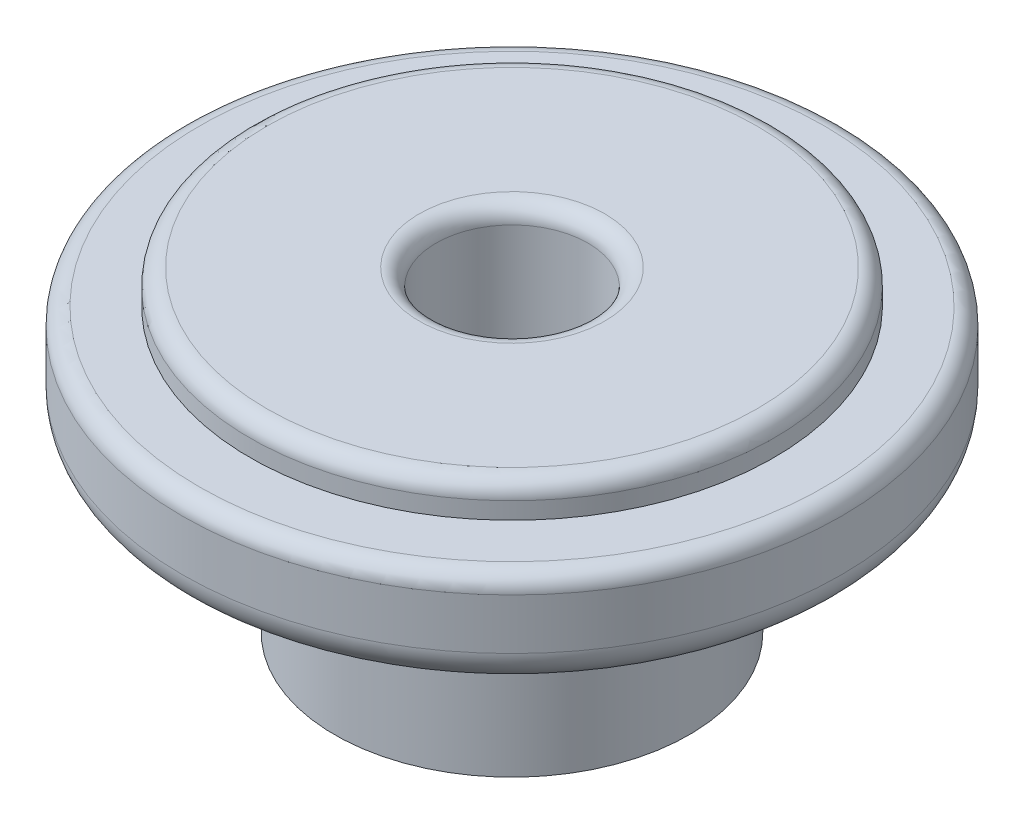
ISO-10303-21;
HEADER;
FILE_DESCRIPTION(('STEP AP214'),'2;1');
FILE_NAME('part.step','',(''),(''),'','','');
FILE_SCHEMA(('AUTOMOTIVE_DESIGN { 1 0 10303 214 1 1 1 1 }'));
ENDSEC;
DATA;
#1=APPLICATION_CONTEXT('core data for automotive mechanical design processes');
#2=APPLICATION_PROTOCOL_DEFINITION('international standard','automotive_design',2000,#1);
#3=PRODUCT_CONTEXT('',#1,'mechanical');
#4=PRODUCT('Part','Part','',(#3));
#5=PRODUCT_RELATED_PRODUCT_CATEGORY('part','',(#4));
#6=PRODUCT_DEFINITION_FORMATION('','',#4);
#7=PRODUCT_DEFINITION_CONTEXT('part definition',#1,'design');
#8=PRODUCT_DEFINITION('design','',#6,#7);
#9=PRODUCT_DEFINITION_SHAPE('','',#8);
#10=(LENGTH_UNIT() NAMED_UNIT(*) SI_UNIT(.MILLI.,.METRE.));
#11=(NAMED_UNIT(*) PLANE_ANGLE_UNIT() SI_UNIT($,.RADIAN.));
#12=(NAMED_UNIT(*) SI_UNIT($,.STERADIAN.) SOLID_ANGLE_UNIT());
#13=UNCERTAINTY_MEASURE_WITH_UNIT(LENGTH_MEASURE(1.E-05),#10,'distance_accuracy_value','');
#14=(GEOMETRIC_REPRESENTATION_CONTEXT(3) GLOBAL_UNCERTAINTY_ASSIGNED_CONTEXT((#13)) GLOBAL_UNIT_ASSIGNED_CONTEXT((#10,
#11,#12)) REPRESENTATION_CONTEXT('',''));
#15=CARTESIAN_POINT('',(0.,0.,0.));
#16=DIRECTION('',(0.,0.,1.));
#17=DIRECTION('',(1.,0.,0.));
#18=AXIS2_PLACEMENT_3D('',#15,#16,#17);
#19=CARTESIAN_POINT('',(-2.2479,0.,0.));
#20=DIRECTION('',(0.,1.,0.));
#21=DIRECTION('',(0.,0.,1.));
#22=AXIS2_PLACEMENT_3D('',#19,#20,#21);
#23=PLANE('',#22);
#24=CARTESIAN_POINT('',(0.,0.,0.));
#25=DIRECTION('',(0.,-1.,0.));
#26=DIRECTION('',(0.,0.,-1.));
#27=AXIS2_PLACEMENT_3D('',#24,#25,#26);
#28=CIRCLE('',#27,2.2479);
#29=CARTESIAN_POINT('',(0.,0.,-2.2479));
#30=VERTEX_POINT('',#29);
#31=EDGE_CURVE('E75',#30,#30,#28,.T.);
#32=ORIENTED_EDGE('',*,*,#31,.F.);
#33=EDGE_LOOP('',(#32));
#34=FACE_BOUND('',#33,.T.);
#35=CARTESIAN_POINT('',(0.,0.,0.));
#36=DIRECTION('',(0.,-1.,0.));
#37=DIRECTION('',(0.,0.,-1.));
#38=AXIS2_PLACEMENT_3D('',#35,#36,#37);
#39=CIRCLE('',#38,5.2479);
#40=CARTESIAN_POINT('',(0.,0.,-5.2479));
#41=VERTEX_POINT('',#40);
#42=EDGE_CURVE('E95',#41,#41,#39,.T.);
#43=ORIENTED_EDGE('',*,*,#42,.T.);
#44=EDGE_LOOP('',(#43));
#45=FACE_BOUND('',#44,.T.);
#46=ADVANCED_FACE('F43',(#34,#45),#23,.F.);
#47=CARTESIAN_POINT('',(0.,0.,0.));
#48=DIRECTION('',(0.,-1.,0.));
#49=DIRECTION('',(0.,0.,-1.));
#50=AXIS2_PLACEMENT_3D('',#47,#48,#49);
#51=CYLINDRICAL_SURFACE('',#50,2.2479);
#52=CARTESIAN_POINT('',(0.,8.85,0.));
#53=DIRECTION('',(0.,-1.,0.));
#54=DIRECTION('',(0.,0.,-1.));
#55=AXIS2_PLACEMENT_3D('',#52,#53,#54);
#56=CIRCLE('',#55,2.2479);
#57=CARTESIAN_POINT('',(0.,8.85,-2.2479));
#58=VERTEX_POINT('',#57);
#59=EDGE_CURVE('E10',#58,#58,#56,.F.);
#60=ORIENTED_EDGE('',*,*,#59,.T.);
#61=EDGE_LOOP('',(#60));
#62=FACE_BOUND('',#61,.T.);
#63=ORIENTED_EDGE('',*,*,#31,.T.);
#64=EDGE_LOOP('',(#63));
#65=FACE_BOUND('',#64,.T.);
#66=ADVANCED_FACE('F133',(#62,#65),#51,.F.);
#67=CARTESIAN_POINT('',(-2.2479,9.35,0.));
#68=DIRECTION('',(0.,-1.,0.));
#69=DIRECTION('',(0.,0.,-1.));
#70=AXIS2_PLACEMENT_3D('',#67,#68,#69);
#71=PLANE('',#70);
#72=CARTESIAN_POINT('',(0.,9.35,0.));
#73=DIRECTION('',(0.,-1.,0.));
#74=DIRECTION('',(0.,0.,-1.));
#75=AXIS2_PLACEMENT_3D('',#72,#73,#74);
#76=CIRCLE('',#75,7.2479);
#77=CARTESIAN_POINT('',(0.,9.35,-7.2479));
#78=VERTEX_POINT('',#77);
#79=EDGE_CURVE('E51',#78,#78,#76,.F.);
#80=ORIENTED_EDGE('',*,*,#79,.T.);
#81=EDGE_LOOP('',(#80));
#82=FACE_BOUND('',#81,.T.);
#83=CARTESIAN_POINT('',(0.,9.35,0.));
#84=DIRECTION('',(0.,-1.,0.));
#85=DIRECTION('',(0.,0.,-1.));
#86=AXIS2_PLACEMENT_3D('',#83,#84,#85);
#87=CIRCLE('',#86,2.7479);
#88=CARTESIAN_POINT('',(0.,9.35,-2.7479));
#89=VERTEX_POINT('',#88);
#90=EDGE_CURVE('E56',#89,#89,#87,.T.);
#91=ORIENTED_EDGE('',*,*,#90,.T.);
#92=EDGE_LOOP('',(#91));
#93=FACE_BOUND('',#92,.T.);
#94=ADVANCED_FACE('F139',(#82,#93),#71,.F.);
#95=CARTESIAN_POINT('',(0.,0.,0.));
#96=DIRECTION('',(0.,-1.,0.));
#97=DIRECTION('',(0.,0.,-1.));
#98=AXIS2_PLACEMENT_3D('',#95,#96,#97);
#99=CYLINDRICAL_SURFACE('',#98,7.7479);
#100=CARTESIAN_POINT('',(0.,8.85,0.));
#101=DIRECTION('',(0.,-1.,0.));
#102=DIRECTION('',(0.,0.,-1.));
#103=AXIS2_PLACEMENT_3D('',#100,#101,#102);
#104=CIRCLE('',#103,7.7479);
#105=CARTESIAN_POINT('',(0.,8.85,-7.7479));
#106=VERTEX_POINT('',#105);
#107=EDGE_CURVE('E61',#106,#106,#104,.T.);
#108=ORIENTED_EDGE('',*,*,#107,.T.);
#109=EDGE_LOOP('',(#108));
#110=FACE_BOUND('',#109,.T.);
#111=CARTESIAN_POINT('',(0.,8.35,0.));
#112=DIRECTION('',(0.,-1.,0.));
#113=DIRECTION('',(0.,0.,-1.));
#114=AXIS2_PLACEMENT_3D('',#111,#112,#113);
#115=CIRCLE('',#114,7.7479);
#116=CARTESIAN_POINT('',(0.,8.35,-7.7479));
#117=VERTEX_POINT('',#116);
#118=EDGE_CURVE('E79',#117,#117,#115,.T.);
#119=ORIENTED_EDGE('',*,*,#118,.F.);
#120=EDGE_LOOP('',(#119));
#121=FACE_BOUND('',#120,.T.);
#122=ADVANCED_FACE('F129',(#110,#121),#99,.T.);
#123=CARTESIAN_POINT('',(-7.7479,8.35,0.));
#124=DIRECTION('',(0.,-1.,0.));
#125=DIRECTION('',(0.,0.,-1.));
#126=AXIS2_PLACEMENT_3D('',#123,#124,#125);
#127=PLANE('',#126);
#128=CARTESIAN_POINT('',(0.,8.35,0.));
#129=DIRECTION('',(0.,-1.,0.));
#130=DIRECTION('',(0.,0.,-1.));
#131=AXIS2_PLACEMENT_3D('',#128,#129,#130);
#132=CIRCLE('',#131,9.2479);
#133=CARTESIAN_POINT('',(0.,8.35,-9.2479));
#134=VERTEX_POINT('',#133);
#135=EDGE_CURVE('E67',#134,#134,#132,.F.);
#136=ORIENTED_EDGE('',*,*,#135,.T.);
#137=EDGE_LOOP('',(#136));
#138=FACE_BOUND('',#137,.T.);
#139=ORIENTED_EDGE('',*,*,#118,.T.);
#140=EDGE_LOOP('',(#139));
#141=FACE_BOUND('',#140,.T.);
#142=ADVANCED_FACE('F122',(#138,#141),#127,.F.);
#143=CARTESIAN_POINT('',(0.,0.,0.));
#144=DIRECTION('',(0.,-1.,0.));
#145=DIRECTION('',(0.,0.,-1.));
#146=AXIS2_PLACEMENT_3D('',#143,#144,#145);
#147=CYLINDRICAL_SURFACE('',#146,9.7479);
#148=CARTESIAN_POINT('',(0.,7.85,0.));
#149=DIRECTION('',(0.,-1.,0.));
#150=DIRECTION('',(0.,0.,-1.));
#151=AXIS2_PLACEMENT_3D('',#148,#149,#150);
#152=CIRCLE('',#151,9.7479);
#153=CARTESIAN_POINT('',(0.,7.85,-9.7479));
#154=VERTEX_POINT('',#153);
#155=EDGE_CURVE('E71',#154,#154,#152,.T.);
#156=ORIENTED_EDGE('',*,*,#155,.T.);
#157=EDGE_LOOP('',(#156));
#158=FACE_BOUND('',#157,.T.);
#159=CARTESIAN_POINT('',(0.,6.35,0.));
#160=DIRECTION('',(0.,-1.,0.));
#161=DIRECTION('',(0.,0.,-1.));
#162=AXIS2_PLACEMENT_3D('',#159,#160,#161);
#163=CIRCLE('',#162,9.7479);
#164=CARTESIAN_POINT('',(0.,6.35,-9.7479));
#165=VERTEX_POINT('',#164);
#166=EDGE_CURVE('E83',#165,#165,#163,.T.);
#167=ORIENTED_EDGE('',*,*,#166,.F.);
#168=EDGE_LOOP('',(#167));
#169=FACE_BOUND('',#168,.T.);
#170=ADVANCED_FACE('F117',(#158,#169),#147,.T.);
#171=CARTESIAN_POINT('',(0.,6.35,0.));
#172=DIRECTION('',(0.,-1.,0.));
#173=DIRECTION('',(0.,0.,-1.));
#174=AXIS2_PLACEMENT_3D('',#171,#172,#173);
#175=TOROIDAL_SURFACE('',#174,8.7479,1.);
#176=CARTESIAN_POINT('',(0.,6.35,0.));
#177=DIRECTION('',(0.,-1.,0.));
#178=DIRECTION('',(0.,0.,-1.));
#179=AXIS2_PLACEMENT_3D('',#176,#177,#178);
#180=CIRCLE('',#179,7.7479);
#181=CARTESIAN_POINT('',(0.,6.35,-7.7479));
#182=VERTEX_POINT('',#181);
#183=EDGE_CURVE('E87',#182,#182,#180,.T.);
#184=ORIENTED_EDGE('',*,*,#183,.F.);
#185=EDGE_LOOP('',(#184));
#186=FACE_BOUND('',#185,.T.);
#187=ORIENTED_EDGE('',*,*,#166,.T.);
#188=EDGE_LOOP('',(#187));
#189=FACE_BOUND('',#188,.T.);
#190=ADVANCED_FACE('F111',(#186,#189),#175,.T.);
#191=CARTESIAN_POINT('',(-5.2479,6.35,0.));
#192=DIRECTION('',(0.,1.,0.));
#193=DIRECTION('',(0.,0.,1.));
#194=AXIS2_PLACEMENT_3D('',#191,#192,#193);
#195=PLANE('',#194);
#196=CARTESIAN_POINT('',(0.,6.35,0.));
#197=DIRECTION('',(0.,-1.,0.));
#198=DIRECTION('',(0.,0.,-1.));
#199=AXIS2_PLACEMENT_3D('',#196,#197,#198);
#200=CIRCLE('',#199,5.2479);
#201=CARTESIAN_POINT('',(0.,6.35,-5.2479));
#202=VERTEX_POINT('',#201);
#203=EDGE_CURVE('E91',#202,#202,#200,.T.);
#204=ORIENTED_EDGE('',*,*,#203,.F.);
#205=EDGE_LOOP('',(#204));
#206=FACE_BOUND('',#205,.T.);
#207=ORIENTED_EDGE('',*,*,#183,.T.);
#208=EDGE_LOOP('',(#207));
#209=FACE_BOUND('',#208,.T.);
#210=ADVANCED_FACE('F105',(#206,#209),#195,.F.);
#211=CARTESIAN_POINT('',(0.,0.,0.));
#212=DIRECTION('',(0.,-1.,0.));
#213=DIRECTION('',(0.,0.,-1.));
#214=AXIS2_PLACEMENT_3D('',#211,#212,#213);
#215=CYLINDRICAL_SURFACE('',#214,5.2479);
#216=ORIENTED_EDGE('',*,*,#42,.F.);
#217=EDGE_LOOP('',(#216));
#218=FACE_BOUND('',#217,.T.);
#219=ORIENTED_EDGE('',*,*,#203,.T.);
#220=EDGE_LOOP('',(#219));
#221=FACE_BOUND('',#220,.T.);
#222=ADVANCED_FACE('F101',(#218,#221),#215,.T.);
#223=CARTESIAN_POINT('',(0.,7.85,0.));
#224=DIRECTION('',(0.,-1.,0.));
#225=DIRECTION('',(0.,0.,-1.));
#226=AXIS2_PLACEMENT_3D('',#223,#224,#225);
#227=TOROIDAL_SURFACE('',#226,9.2479,0.5);
#228=ORIENTED_EDGE('',*,*,#135,.F.);
#229=EDGE_LOOP('',(#228));
#230=FACE_BOUND('',#229,.T.);
#231=ORIENTED_EDGE('',*,*,#155,.F.);
#232=EDGE_LOOP('',(#231));
#233=FACE_BOUND('',#232,.T.);
#234=ADVANCED_FACE('F104',(#230,#233),#227,.T.);
#235=CARTESIAN_POINT('',(0.,8.85,0.));
#236=DIRECTION('',(0.,-1.,0.));
#237=DIRECTION('',(0.,0.,-1.));
#238=AXIS2_PLACEMENT_3D('',#235,#236,#237);
#239=TOROIDAL_SURFACE('',#238,7.2479,0.5);
#240=ORIENTED_EDGE('',*,*,#79,.F.);
#241=EDGE_LOOP('',(#240));
#242=FACE_BOUND('',#241,.T.);
#243=ORIENTED_EDGE('',*,*,#107,.F.);
#244=EDGE_LOOP('',(#243));
#245=FACE_BOUND('',#244,.T.);
#246=ADVANCED_FACE('F144',(#242,#245),#239,.T.);
#247=CARTESIAN_POINT('',(0.,8.85,0.));
#248=DIRECTION('',(0.,-1.,0.));
#249=DIRECTION('',(0.,0.,-1.));
#250=AXIS2_PLACEMENT_3D('',#247,#248,#249);
#251=TOROIDAL_SURFACE('',#250,2.7479,0.5);
#252=ORIENTED_EDGE('',*,*,#59,.F.);
#253=EDGE_LOOP('',(#252));
#254=FACE_BOUND('',#253,.T.);
#255=ORIENTED_EDGE('',*,*,#90,.F.);
#256=EDGE_LOOP('',(#255));
#257=FACE_BOUND('',#256,.T.);
#258=ADVANCED_FACE('F45',(#254,#257),#251,.T.);
#259=CLOSED_SHELL('',(#46,#66,#94,#122,#142,#170,#190,#210,#222,#234,#246,#258));
#260=MANIFOLD_SOLID_BREP('B2',#259);
#261=ADVANCED_BREP_SHAPE_REPRESENTATION('',(#18,#260),#14);
#262=SHAPE_DEFINITION_REPRESENTATION(#9,#261);
ENDSEC;
END-ISO-10303-21;
